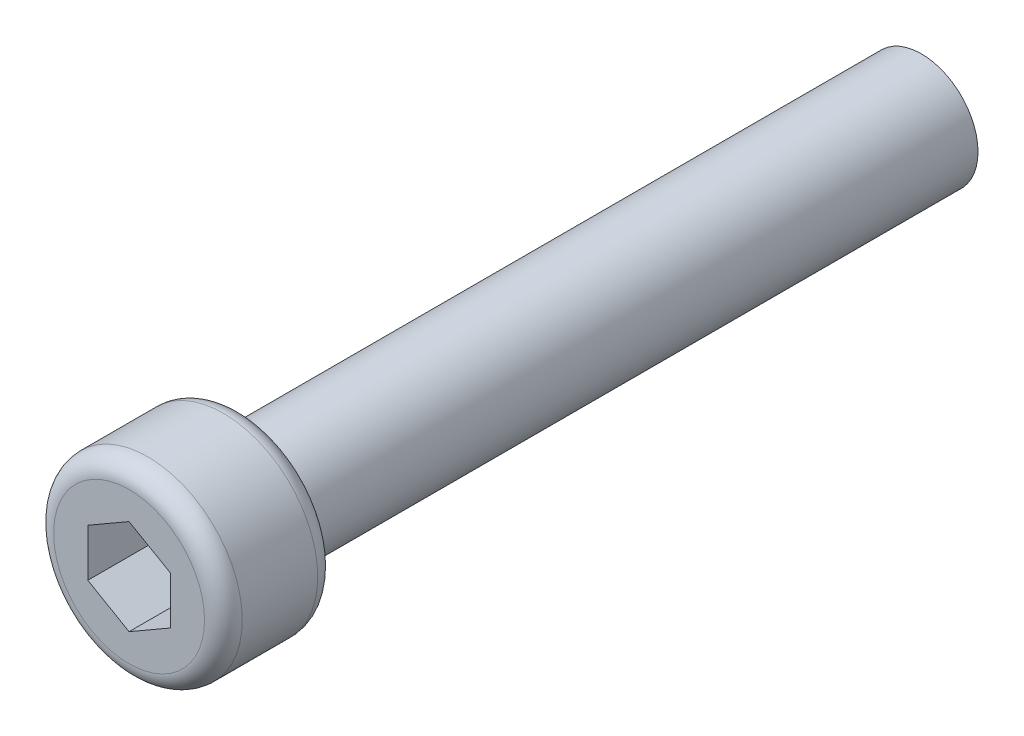
ISO-10303-21;
HEADER;
FILE_DESCRIPTION(('STEP AP214'),'2;1');
FILE_NAME('part.step','',(''),(''),'','','');
FILE_SCHEMA(('AUTOMOTIVE_DESIGN { 1 0 10303 214 1 1 1 1 }'));
ENDSEC;
DATA;
#1=APPLICATION_CONTEXT('core data for automotive mechanical design processes');
#2=APPLICATION_PROTOCOL_DEFINITION('international standard','automotive_design',2000,#1);
#3=PRODUCT_CONTEXT('',#1,'mechanical');
#4=PRODUCT('Part','Part','',(#3));
#5=PRODUCT_RELATED_PRODUCT_CATEGORY('part','',(#4));
#6=PRODUCT_DEFINITION_FORMATION('','',#4);
#7=PRODUCT_DEFINITION_CONTEXT('part definition',#1,'design');
#8=PRODUCT_DEFINITION('design','',#6,#7);
#9=PRODUCT_DEFINITION_SHAPE('','',#8);
#10=(LENGTH_UNIT() NAMED_UNIT(*) SI_UNIT(.MILLI.,.METRE.));
#11=(NAMED_UNIT(*) PLANE_ANGLE_UNIT() SI_UNIT($,.RADIAN.));
#12=(NAMED_UNIT(*) SI_UNIT($,.STERADIAN.) SOLID_ANGLE_UNIT());
#13=UNCERTAINTY_MEASURE_WITH_UNIT(LENGTH_MEASURE(1.E-05),#10,'distance_accuracy_value','');
#14=(GEOMETRIC_REPRESENTATION_CONTEXT(3) GLOBAL_UNCERTAINTY_ASSIGNED_CONTEXT((#13)) GLOBAL_UNIT_ASSIGNED_CONTEXT((#10,
#11,#12)) REPRESENTATION_CONTEXT('',''));
#15=CARTESIAN_POINT('',(0.,0.,0.));
#16=DIRECTION('',(0.,0.,1.));
#17=DIRECTION('',(1.,0.,0.));
#18=AXIS2_PLACEMENT_3D('',#15,#16,#17);
#19=CARTESIAN_POINT('',(0.,1.5841809112381,-18.));
#20=DIRECTION('',(0.,0.,1.));
#21=DIRECTION('',(1.,0.,0.));
#22=AXIS2_PLACEMENT_3D('',#19,#20,#21);
#23=CYLINDRICAL_SURFACE('',#22,1.5);
#24=CARTESIAN_POINT('',(0.,1.5841809112381,-18.));
#25=DIRECTION('',(0.,0.,1.));
#26=DIRECTION('',(1.,0.,0.));
#27=AXIS2_PLACEMENT_3D('',#24,#25,#26);
#28=CIRCLE('',#27,1.5);
#29=CARTESIAN_POINT('',(1.5,1.5841809112381,-18.));
#30=VERTEX_POINT('',#29);
#31=EDGE_CURVE('E140',#30,#30,#28,.T.);
#32=ORIENTED_EDGE('',*,*,#31,.T.);
#33=EDGE_LOOP('',(#32));
#34=FACE_BOUND('',#33,.T.);
#35=CARTESIAN_POINT('',(0.,1.5841809112381,0.));
#36=DIRECTION('',(0.,0.,1.));
#37=DIRECTION('',(1.,0.,0.));
#38=AXIS2_PLACEMENT_3D('',#35,#36,#37);
#39=CIRCLE('',#38,1.5);
#40=CARTESIAN_POINT('',(1.5,1.5841809112381,0.));
#41=VERTEX_POINT('',#40);
#42=EDGE_CURVE('E134',#41,#41,#39,.T.);
#43=ORIENTED_EDGE('',*,*,#42,.F.);
#44=EDGE_LOOP('',(#43));
#45=FACE_BOUND('',#44,.T.);
#46=ADVANCED_FACE('F32',(#34,#45),#23,.T.);
#47=CARTESIAN_POINT('',(0.,1.5841809112381,-18.));
#48=DIRECTION('',(0.,0.,1.));
#49=DIRECTION('',(1.,0.,0.));
#50=AXIS2_PLACEMENT_3D('',#47,#48,#49);
#51=PLANE('',#50);
#52=ORIENTED_EDGE('',*,*,#31,.F.);
#53=EDGE_LOOP('',(#52));
#54=FACE_BOUND('',#53,.T.);
#55=ADVANCED_FACE('F172',(#54),#51,.F.);
#56=CARTESIAN_POINT('',(0.,1.5841809112381,3.));
#57=DIRECTION('',(0.,0.,-1.));
#58=DIRECTION('',(-1.,0.,0.));
#59=AXIS2_PLACEMENT_3D('',#56,#57,#58);
#60=CYLINDRICAL_SURFACE('',#59,2.5);
#61=CARTESIAN_POINT('',(0.,1.5841809112381,2.5));
#62=DIRECTION('',(0.,0.,1.));
#63=DIRECTION('',(1.,0.,0.));
#64=AXIS2_PLACEMENT_3D('',#61,#62,#63);
#65=CIRCLE('',#64,2.5);
#66=CARTESIAN_POINT('',(2.5,1.5841809112381,2.5));
#67=VERTEX_POINT('',#66);
#68=EDGE_CURVE('E40',#67,#67,#65,.F.);
#69=ORIENTED_EDGE('',*,*,#68,.T.);
#70=EDGE_LOOP('',(#69));
#71=FACE_BOUND('',#70,.T.);
#72=CARTESIAN_POINT('',(0.,1.5841809112381,0.5));
#73=DIRECTION('',(0.,0.,1.));
#74=DIRECTION('',(1.,0.,0.));
#75=AXIS2_PLACEMENT_3D('',#72,#73,#74);
#76=CIRCLE('',#75,2.5);
#77=CARTESIAN_POINT('',(2.5,1.5841809112381,0.5));
#78=VERTEX_POINT('',#77);
#79=EDGE_CURVE('E148',#78,#78,#76,.T.);
#80=ORIENTED_EDGE('',*,*,#79,.T.);
#81=EDGE_LOOP('',(#80));
#82=FACE_BOUND('',#81,.T.);
#83=ADVANCED_FACE('F153',(#71,#82),#60,.T.);
#84=CARTESIAN_POINT('',(0.,1.5841809112381,3.));
#85=DIRECTION('',(0.,0.,1.));
#86=DIRECTION('',(1.,0.,0.));
#87=AXIS2_PLACEMENT_3D('',#84,#85,#86);
#88=PLANE('',#87);
#89=DIRECTION('',(0.866025403784442,-0.499999999999995,0.));
#90=VECTOR('',#89,1.);
#91=CARTESIAN_POINT('',(-1.09424798505393,0.952416542506997,3.));
#92=LINE('',#91,#90);
#93=CARTESIAN_POINT('',(-1.09424798505393,0.952416542506997,3.));
#94=VERTEX_POINT('',#93);
#95=CARTESIAN_POINT('',(0.,0.320652173775915,3.));
#96=VERTEX_POINT('',#95);
#97=EDGE_CURVE('E47',#94,#96,#92,.T.);
#98=ORIENTED_EDGE('',*,*,#97,.F.);
#99=DIRECTION('',(0.,-1.,0.));
#100=VECTOR('',#99,1.);
#101=CARTESIAN_POINT('',(-1.09424798505394,2.21594527996919,3.));
#102=LINE('',#101,#100);
#103=CARTESIAN_POINT('',(-1.09424798505394,2.21594527996919,3.));
#104=VERTEX_POINT('',#103);
#105=EDGE_CURVE('E130',#104,#94,#102,.T.);
#106=ORIENTED_EDGE('',*,*,#105,.F.);
#107=DIRECTION('',(-0.866025403784434,-0.500000000000007,0.));
#108=VECTOR('',#107,1.);
#109=CARTESIAN_POINT('',(0.,2.84770964870029,3.));
#110=LINE('',#109,#108);
#111=CARTESIAN_POINT('',(0.,2.84770964870029,3.));
#112=VERTEX_POINT('',#111);
#113=EDGE_CURVE('E128',#112,#104,#110,.T.);
#114=ORIENTED_EDGE('',*,*,#113,.F.);
#115=DIRECTION('',(-0.866025403784441,0.499999999999995,0.));
#116=VECTOR('',#115,1.);
#117=CARTESIAN_POINT('',(1.09424798505393,2.2159452799692,3.));
#118=LINE('',#117,#116);
#119=CARTESIAN_POINT('',(1.09424798505393,2.2159452799692,3.));
#120=VERTEX_POINT('',#119);
#121=EDGE_CURVE('E95',#120,#112,#118,.T.);
#122=ORIENTED_EDGE('',*,*,#121,.F.);
#123=DIRECTION('',(0.,1.,0.));
#124=VECTOR('',#123,1.);
#125=CARTESIAN_POINT('',(1.09424798505394,0.952416542507012,3.));
#126=LINE('',#125,#124);
#127=CARTESIAN_POINT('',(1.09424798505394,0.952416542507012,3.));
#128=VERTEX_POINT('',#127);
#129=EDGE_CURVE('E124',#128,#120,#126,.T.);
#130=ORIENTED_EDGE('',*,*,#129,.F.);
#131=DIRECTION('',(0.866025403784438,0.500000000000001,0.));
#132=VECTOR('',#131,1.);
#133=CARTESIAN_POINT('',(0.,0.320652173775915,3.));
#134=LINE('',#133,#132);
#135=EDGE_CURVE('E121',#96,#128,#134,.T.);
#136=ORIENTED_EDGE('',*,*,#135,.F.);
#137=EDGE_LOOP('',(#98,#106,#114,#122,#130,#136));
#138=FACE_BOUND('',#137,.T.);
#139=CARTESIAN_POINT('',(0.,1.5841809112381,3.));
#140=DIRECTION('',(0.,0.,1.));
#141=DIRECTION('',(1.,0.,0.));
#142=AXIS2_PLACEMENT_3D('',#139,#140,#141);
#143=CIRCLE('',#142,2.);
#144=CARTESIAN_POINT('',(2.,1.5841809112381,3.));
#145=VERTEX_POINT('',#144);
#146=EDGE_CURVE('E143',#145,#145,#143,.T.);
#147=ORIENTED_EDGE('',*,*,#146,.T.);
#148=EDGE_LOOP('',(#147));
#149=FACE_BOUND('',#148,.T.);
#150=ADVANCED_FACE('F162',(#138,#149),#88,.T.);
#151=CARTESIAN_POINT('',(0.,1.5841809112381,0.));
#152=DIRECTION('',(0.,0.,1.));
#153=DIRECTION('',(1.,0.,0.));
#154=AXIS2_PLACEMENT_3D('',#151,#152,#153);
#155=PLANE('',#154);
#156=CARTESIAN_POINT('',(0.,1.5841809112381,0.));
#157=DIRECTION('',(0.,0.,1.));
#158=DIRECTION('',(1.,0.,0.));
#159=AXIS2_PLACEMENT_3D('',#156,#157,#158);
#160=CIRCLE('',#159,2.);
#161=CARTESIAN_POINT('',(2.,1.5841809112381,0.));
#162=VERTEX_POINT('',#161);
#163=EDGE_CURVE('E11',#162,#162,#160,.F.);
#164=ORIENTED_EDGE('',*,*,#163,.T.);
#165=EDGE_LOOP('',(#164));
#166=FACE_BOUND('',#165,.T.);
#167=ORIENTED_EDGE('',*,*,#42,.T.);
#168=EDGE_LOOP('',(#167));
#169=FACE_BOUND('',#168,.T.);
#170=ADVANCED_FACE('F159',(#166,#169),#155,.F.);
#171=CARTESIAN_POINT('',(0.,1.5841809112381,2.5));
#172=DIRECTION('',(0.,0.,1.));
#173=DIRECTION('',(1.,0.,0.));
#174=AXIS2_PLACEMENT_3D('',#171,#172,#173);
#175=TOROIDAL_SURFACE('',#174,2.,0.5);
#176=ORIENTED_EDGE('',*,*,#68,.F.);
#177=EDGE_LOOP('',(#176));
#178=FACE_BOUND('',#177,.T.);
#179=ORIENTED_EDGE('',*,*,#146,.F.);
#180=EDGE_LOOP('',(#179));
#181=FACE_BOUND('',#180,.T.);
#182=ADVANCED_FACE('F156',(#178,#181),#175,.T.);
#183=CARTESIAN_POINT('',(0.,1.5841809112381,0.5));
#184=DIRECTION('',(0.,0.,1.));
#185=DIRECTION('',(1.,0.,0.));
#186=AXIS2_PLACEMENT_3D('',#183,#184,#185);
#187=TOROIDAL_SURFACE('',#186,2.,0.5);
#188=ORIENTED_EDGE('',*,*,#163,.F.);
#189=EDGE_LOOP('',(#188));
#190=FACE_BOUND('',#189,.T.);
#191=ORIENTED_EDGE('',*,*,#79,.F.);
#192=EDGE_LOOP('',(#191));
#193=FACE_BOUND('',#192,.T.);
#194=ADVANCED_FACE('F34',(#190,#193),#187,.T.);
#195=CARTESIAN_POINT('',(-1.09424798505393,0.952416542506997,1.));
#196=DIRECTION('',(-0.499999999999995,-0.866025403784441,0.));
#197=DIRECTION('',(0.866025403784442,-0.499999999999995,0.));
#198=AXIS2_PLACEMENT_3D('',#195,#196,#197);
#199=PLANE('',#198);
#200=ORIENTED_EDGE('',*,*,#97,.T.);
#201=DIRECTION('',(0.,0.,1.));
#202=VECTOR('',#201,1.);
#203=CARTESIAN_POINT('',(0.,0.320652173775915,1.));
#204=LINE('',#203,#202);
#205=CARTESIAN_POINT('',(0.,0.320652173775915,1.));
#206=VERTEX_POINT('',#205);
#207=EDGE_CURVE('E77',#206,#96,#204,.T.);
#208=ORIENTED_EDGE('',*,*,#207,.F.);
#209=DIRECTION('',(0.866025403784442,-0.499999999999995,0.));
#210=VECTOR('',#209,1.);
#211=CARTESIAN_POINT('',(-1.09424798505393,0.952416542506997,1.));
#212=LINE('',#211,#210);
#213=CARTESIAN_POINT('',(-1.09424798505393,0.952416542506997,1.));
#214=VERTEX_POINT('',#213);
#215=EDGE_CURVE('E132',#214,#206,#212,.T.);
#216=ORIENTED_EDGE('',*,*,#215,.F.);
#217=DIRECTION('',(0.,0.,1.));
#218=VECTOR('',#217,1.);
#219=CARTESIAN_POINT('',(-1.09424798505393,0.952416542506997,1.));
#220=LINE('',#219,#218);
#221=EDGE_CURVE('E55',#214,#94,#220,.T.);
#222=ORIENTED_EDGE('',*,*,#221,.T.);
#223=EDGE_LOOP('',(#200,#208,#216,#222));
#224=FACE_BOUND('',#223,.T.);
#225=ADVANCED_FACE('F214',(#224),#199,.F.);
#226=CARTESIAN_POINT('',(-1.09424798505394,2.21594527996919,1.));
#227=DIRECTION('',(-1.,0.,0.));
#228=DIRECTION('',(0.,-1.,0.));
#229=AXIS2_PLACEMENT_3D('',#226,#227,#228);
#230=PLANE('',#229);
#231=ORIENTED_EDGE('',*,*,#105,.T.);
#232=ORIENTED_EDGE('',*,*,#221,.F.);
#233=DIRECTION('',(0.,-1.,0.));
#234=VECTOR('',#233,1.);
#235=CARTESIAN_POINT('',(-1.09424798505394,2.21594527996919,1.));
#236=LINE('',#235,#234);
#237=CARTESIAN_POINT('',(-1.09424798505394,2.21594527996919,1.));
#238=VERTEX_POINT('',#237);
#239=EDGE_CURVE('E107',#238,#214,#236,.T.);
#240=ORIENTED_EDGE('',*,*,#239,.F.);
#241=DIRECTION('',(0.,0.,1.));
#242=VECTOR('',#241,1.);
#243=CARTESIAN_POINT('',(-1.09424798505394,2.21594527996919,1.));
#244=LINE('',#243,#242);
#245=EDGE_CURVE('E99',#238,#104,#244,.T.);
#246=ORIENTED_EDGE('',*,*,#245,.T.);
#247=EDGE_LOOP('',(#231,#232,#240,#246));
#248=FACE_BOUND('',#247,.T.);
#249=ADVANCED_FACE('F227',(#248),#230,.F.);
#250=CARTESIAN_POINT('',(0.,2.84770964870029,1.));
#251=DIRECTION('',(-0.500000000000007,0.866025403784434,0.));
#252=DIRECTION('',(-0.866025403784435,-0.500000000000007,0.));
#253=AXIS2_PLACEMENT_3D('',#250,#251,#252);
#254=PLANE('',#253);
#255=ORIENTED_EDGE('',*,*,#113,.T.);
#256=ORIENTED_EDGE('',*,*,#245,.F.);
#257=DIRECTION('',(-0.866025403784434,-0.500000000000007,0.));
#258=VECTOR('',#257,1.);
#259=CARTESIAN_POINT('',(0.,2.84770964870029,1.));
#260=LINE('',#259,#258);
#261=CARTESIAN_POINT('',(0.,2.84770964870029,1.));
#262=VERTEX_POINT('',#261);
#263=EDGE_CURVE('E103',#262,#238,#260,.T.);
#264=ORIENTED_EDGE('',*,*,#263,.F.);
#265=DIRECTION('',(0.,0.,1.));
#266=VECTOR('',#265,1.);
#267=CARTESIAN_POINT('',(0.,2.84770964870029,1.));
#268=LINE('',#267,#266);
#269=EDGE_CURVE('E88',#262,#112,#268,.T.);
#270=ORIENTED_EDGE('',*,*,#269,.T.);
#271=EDGE_LOOP('',(#255,#256,#264,#270));
#272=FACE_BOUND('',#271,.T.);
#273=ADVANCED_FACE('F104',(#272),#254,.F.);
#274=CARTESIAN_POINT('',(1.09424798505393,2.2159452799692,1.));
#275=DIRECTION('',(0.499999999999995,0.866025403784441,0.));
#276=DIRECTION('',(-0.866025403784441,0.499999999999995,0.));
#277=AXIS2_PLACEMENT_3D('',#274,#275,#276);
#278=PLANE('',#277);
#279=ORIENTED_EDGE('',*,*,#121,.T.);
#280=ORIENTED_EDGE('',*,*,#269,.F.);
#281=DIRECTION('',(-0.866025403784441,0.499999999999995,0.));
#282=VECTOR('',#281,1.);
#283=CARTESIAN_POINT('',(1.09424798505393,2.2159452799692,1.));
#284=LINE('',#283,#282);
#285=CARTESIAN_POINT('',(1.09424798505393,2.2159452799692,1.));
#286=VERTEX_POINT('',#285);
#287=EDGE_CURVE('E92',#286,#262,#284,.T.);
#288=ORIENTED_EDGE('',*,*,#287,.F.);
#289=DIRECTION('',(0.,0.,1.));
#290=VECTOR('',#289,1.);
#291=CARTESIAN_POINT('',(1.09424798505393,2.2159452799692,1.));
#292=LINE('',#291,#290);
#293=EDGE_CURVE('E100',#286,#120,#292,.T.);
#294=ORIENTED_EDGE('',*,*,#293,.T.);
#295=EDGE_LOOP('',(#279,#280,#288,#294));
#296=FACE_BOUND('',#295,.T.);
#297=ADVANCED_FACE('F90',(#296),#278,.F.);
#298=CARTESIAN_POINT('',(1.09424798505394,0.952416542507012,1.));
#299=DIRECTION('',(1.,0.,0.));
#300=DIRECTION('',(0.,1.,0.));
#301=AXIS2_PLACEMENT_3D('',#298,#299,#300);
#302=PLANE('',#301);
#303=ORIENTED_EDGE('',*,*,#129,.T.);
#304=ORIENTED_EDGE('',*,*,#293,.F.);
#305=DIRECTION('',(0.,1.,0.));
#306=VECTOR('',#305,1.);
#307=CARTESIAN_POINT('',(1.09424798505394,0.952416542507012,1.));
#308=LINE('',#307,#306);
#309=CARTESIAN_POINT('',(1.09424798505394,0.952416542507012,1.));
#310=VERTEX_POINT('',#309);
#311=EDGE_CURVE('E113',#310,#286,#308,.T.);
#312=ORIENTED_EDGE('',*,*,#311,.F.);
#313=DIRECTION('',(0.,0.,1.));
#314=VECTOR('',#313,1.);
#315=CARTESIAN_POINT('',(1.09424798505394,0.952416542507012,1.));
#316=LINE('',#315,#314);
#317=EDGE_CURVE('E137',#310,#128,#316,.T.);
#318=ORIENTED_EDGE('',*,*,#317,.T.);
#319=EDGE_LOOP('',(#303,#304,#312,#318));
#320=FACE_BOUND('',#319,.T.);
#321=ADVANCED_FACE('F251',(#320),#302,.F.);
#322=CARTESIAN_POINT('',(0.,0.320652173775915,1.));
#323=DIRECTION('',(0.500000000000001,-0.866025403784438,0.));
#324=DIRECTION('',(0.866025403784438,0.500000000000001,0.));
#325=AXIS2_PLACEMENT_3D('',#322,#323,#324);
#326=PLANE('',#325);
#327=ORIENTED_EDGE('',*,*,#135,.T.);
#328=ORIENTED_EDGE('',*,*,#317,.F.);
#329=DIRECTION('',(0.866025403784438,0.500000000000001,0.));
#330=VECTOR('',#329,1.);
#331=CARTESIAN_POINT('',(0.,0.320652173775915,1.));
#332=LINE('',#331,#330);
#333=EDGE_CURVE('E115',#206,#310,#332,.T.);
#334=ORIENTED_EDGE('',*,*,#333,.F.);
#335=ORIENTED_EDGE('',*,*,#207,.T.);
#336=EDGE_LOOP('',(#327,#328,#334,#335));
#337=FACE_BOUND('',#336,.T.);
#338=ADVANCED_FACE('F260',(#337),#326,.F.);
#339=CARTESIAN_POINT('',(0.,0.,1.));
#340=DIRECTION('',(0.,0.,1.));
#341=DIRECTION('',(1.,0.,0.));
#342=AXIS2_PLACEMENT_3D('',#339,#340,#341);
#343=PLANE('',#342);
#344=ORIENTED_EDGE('',*,*,#215,.T.);
#345=ORIENTED_EDGE('',*,*,#333,.T.);
#346=ORIENTED_EDGE('',*,*,#311,.T.);
#347=ORIENTED_EDGE('',*,*,#287,.T.);
#348=ORIENTED_EDGE('',*,*,#263,.T.);
#349=ORIENTED_EDGE('',*,*,#239,.T.);
#350=EDGE_LOOP('',(#344,#345,#346,#347,#348,#349));
#351=FACE_BOUND('',#350,.T.);
#352=ADVANCED_FACE('F110',(#351),#343,.T.);
#353=CLOSED_SHELL('',(#46,#55,#83,#150,#170,#182,#194,#225,#249,#273,#297,#321,#338,#352));
#354=MANIFOLD_SOLID_BREP('B2',#353);
#355=ADVANCED_BREP_SHAPE_REPRESENTATION('',(#18,#354),#14);
#356=SHAPE_DEFINITION_REPRESENTATION(#9,#355);
ENDSEC;
END-ISO-10303-21;
